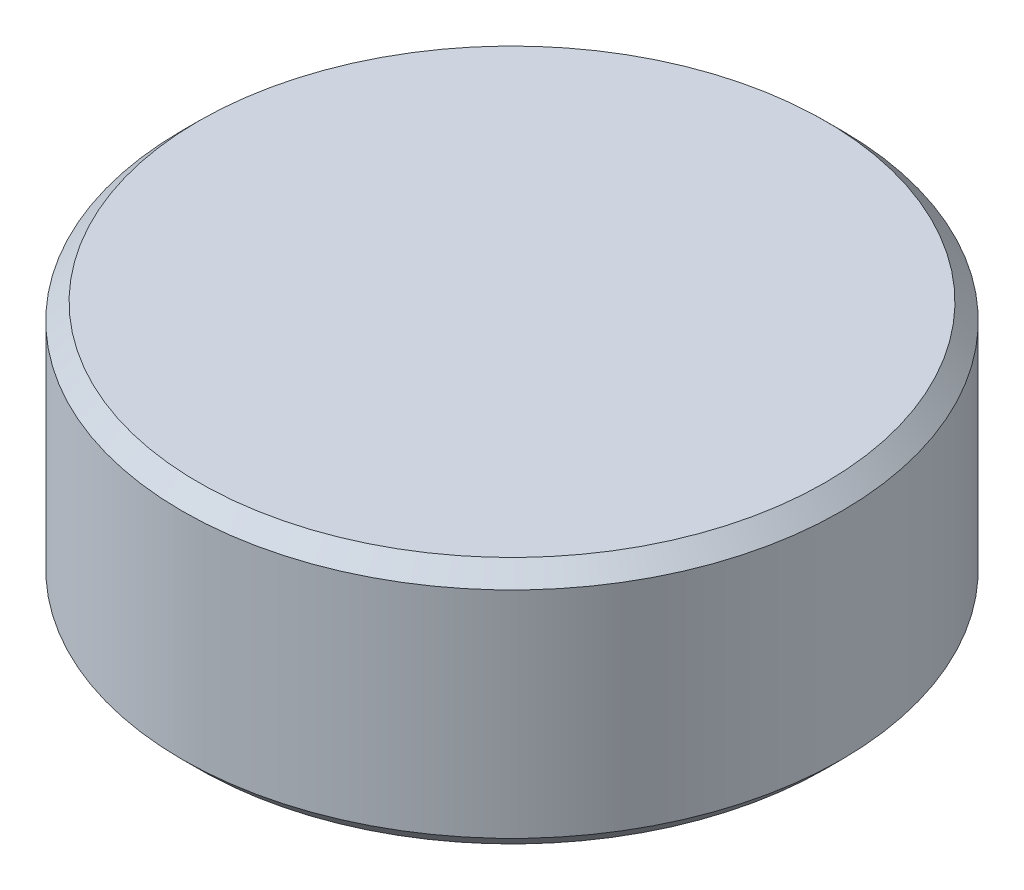
ISO-10303-21;
HEADER;
FILE_DESCRIPTION(('STEP AP214'),'2;1');
FILE_NAME('part.step','',(''),(''),'','','');
FILE_SCHEMA(('AUTOMOTIVE_DESIGN { 1 0 10303 214 1 1 1 1 }'));
ENDSEC;
DATA;
#1=APPLICATION_CONTEXT('core data for automotive mechanical design processes');
#2=APPLICATION_PROTOCOL_DEFINITION('international standard','automotive_design',2000,#1);
#3=PRODUCT_CONTEXT('',#1,'mechanical');
#4=PRODUCT('Part','Part','',(#3));
#5=PRODUCT_RELATED_PRODUCT_CATEGORY('part','',(#4));
#6=PRODUCT_DEFINITION_FORMATION('','',#4);
#7=PRODUCT_DEFINITION_CONTEXT('part definition',#1,'design');
#8=PRODUCT_DEFINITION('design','',#6,#7);
#9=PRODUCT_DEFINITION_SHAPE('','',#8);
#10=(LENGTH_UNIT() NAMED_UNIT(*) SI_UNIT(.MILLI.,.METRE.));
#11=(NAMED_UNIT(*) PLANE_ANGLE_UNIT() SI_UNIT($,.RADIAN.));
#12=(NAMED_UNIT(*) SI_UNIT($,.STERADIAN.) SOLID_ANGLE_UNIT());
#13=UNCERTAINTY_MEASURE_WITH_UNIT(LENGTH_MEASURE(1.E-05),#10,'distance_accuracy_value','');
#14=(GEOMETRIC_REPRESENTATION_CONTEXT(3) GLOBAL_UNCERTAINTY_ASSIGNED_CONTEXT((#13)) GLOBAL_UNIT_ASSIGNED_CONTEXT((#10,
#11,#12)) REPRESENTATION_CONTEXT('',''));
#15=CARTESIAN_POINT('',(0.,0.,0.));
#16=DIRECTION('',(0.,0.,1.));
#17=DIRECTION('',(1.,0.,0.));
#18=AXIS2_PLACEMENT_3D('',#15,#16,#17);
#19=CARTESIAN_POINT('',(0.,-5.375,284.8));
#20=DIRECTION('',(0.,1.,0.));
#21=DIRECTION('',(0.,0.,1.));
#22=AXIS2_PLACEMENT_3D('',#19,#20,#21);
#23=PLANE('',#22);
#24=CARTESIAN_POINT('',(0.,-5.375,284.8));
#25=DIRECTION('',(0.,-1.,0.));
#26=DIRECTION('',(-1.,0.,0.));
#27=AXIS2_PLACEMENT_3D('',#24,#25,#26);
#28=CIRCLE('',#27,38.);
#29=CARTESIAN_POINT('',(-38.,-5.375,284.8));
#30=VERTEX_POINT('',#29);
#31=EDGE_CURVE('E56',#30,#30,#28,.T.);
#32=ORIENTED_EDGE('',*,*,#31,.T.);
#33=EDGE_LOOP('',(#32));
#34=FACE_BOUND('',#33,.T.);
#35=ADVANCED_FACE('F17',(#34),#23,.F.);
#36=CARTESIAN_POINT('',(0.,24.725,284.8));
#37=DIRECTION('',(0.,1.,0.));
#38=DIRECTION('',(0.,0.,1.));
#39=AXIS2_PLACEMENT_3D('',#36,#37,#38);
#40=PLANE('',#39);
#41=CARTESIAN_POINT('',(0.,24.725,284.8));
#42=DIRECTION('',(0.,1.,0.));
#43=DIRECTION('',(-1.,0.,0.));
#44=AXIS2_PLACEMENT_3D('',#41,#42,#43);
#45=CIRCLE('',#44,38.);
#46=CARTESIAN_POINT('',(38.,24.725,284.8));
#47=VERTEX_POINT('',#46);
#48=EDGE_CURVE('E27',#47,#47,#45,.T.);
#49=ORIENTED_EDGE('',*,*,#48,.T.);
#50=EDGE_LOOP('',(#49));
#51=FACE_BOUND('',#50,.T.);
#52=ADVANCED_FACE('F19',(#51),#40,.T.);
#53=CARTESIAN_POINT('',(0.,24.725,284.8));
#54=DIRECTION('',(0.,-1.,0.));
#55=DIRECTION('',(1.,0.,0.));
#56=AXIS2_PLACEMENT_3D('',#53,#54,#55);
#57=CYLINDRICAL_SURFACE('',#56,40.);
#58=CARTESIAN_POINT('',(0.,-3.375,284.8));
#59=DIRECTION('',(0.,1.,0.));
#60=DIRECTION('',(-1.,0.,0.));
#61=AXIS2_PLACEMENT_3D('',#58,#59,#60);
#62=CIRCLE('',#61,40.);
#63=CARTESIAN_POINT('',(-40.,-3.375,284.8));
#64=VERTEX_POINT('',#63);
#65=EDGE_CURVE('E21',#64,#64,#62,.T.);
#66=ORIENTED_EDGE('',*,*,#65,.T.);
#67=EDGE_LOOP('',(#66));
#68=FACE_BOUND('',#67,.T.);
#69=CARTESIAN_POINT('',(0.,22.725,284.8));
#70=DIRECTION('',(0.,-1.,0.));
#71=DIRECTION('',(-1.,0.,0.));
#72=AXIS2_PLACEMENT_3D('',#69,#70,#71);
#73=CIRCLE('',#72,40.);
#74=CARTESIAN_POINT('',(40.,22.725,284.8));
#75=VERTEX_POINT('',#74);
#76=EDGE_CURVE('E11',#75,#75,#73,.T.);
#77=ORIENTED_EDGE('',*,*,#76,.T.);
#78=EDGE_LOOP('',(#77));
#79=FACE_BOUND('',#78,.T.);
#80=ADVANCED_FACE('F81',(#68,#79),#57,.T.);
#81=CARTESIAN_POINT('',(0.,24.725,284.8));
#82=DIRECTION('',(0.,-1.,0.));
#83=DIRECTION('',(1.,0.,0.));
#84=AXIS2_PLACEMENT_3D('',#81,#82,#83);
#85=CONICAL_SURFACE('',#84,38.,0.785398163397448);
#86=ORIENTED_EDGE('',*,*,#76,.F.);
#87=EDGE_LOOP('',(#86));
#88=FACE_BOUND('',#87,.T.);
#89=ORIENTED_EDGE('',*,*,#48,.F.);
#90=EDGE_LOOP('',(#89));
#91=FACE_BOUND('',#90,.T.);
#92=ADVANCED_FACE('F75',(#88,#91),#85,.T.);
#93=CARTESIAN_POINT('',(0.,-3.375,284.8));
#94=DIRECTION('',(0.,1.,0.));
#95=DIRECTION('',(-1.,0.,0.));
#96=AXIS2_PLACEMENT_3D('',#93,#94,#95);
#97=CONICAL_SURFACE('',#96,40.,0.785398163397448);
#98=ORIENTED_EDGE('',*,*,#65,.F.);
#99=EDGE_LOOP('',(#98));
#100=FACE_BOUND('',#99,.T.);
#101=ORIENTED_EDGE('',*,*,#31,.F.);
#102=EDGE_LOOP('',(#101));
#103=FACE_BOUND('',#102,.T.);
#104=ADVANCED_FACE('F80',(#100,#103),#97,.T.);
#105=CLOSED_SHELL('',(#35,#52,#80,#92,#104));
#106=MANIFOLD_SOLID_BREP('B1',#105);
#107=ADVANCED_BREP_SHAPE_REPRESENTATION('',(#18,#106),#14);
#108=SHAPE_DEFINITION_REPRESENTATION(#9,#107);
ENDSEC;
END-ISO-10303-21;
